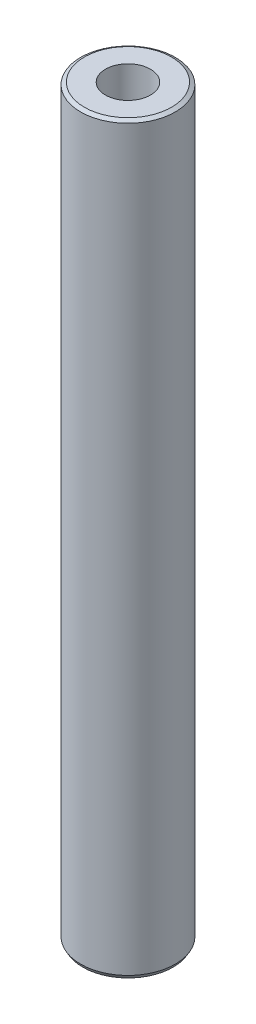
ISO-10303-21;
HEADER;
FILE_DESCRIPTION(('STEP AP214'),'2;1');
FILE_NAME('part.step','',(''),(''),'','','');
FILE_SCHEMA(('AUTOMOTIVE_DESIGN { 1 0 10303 214 1 1 1 1 }'));
ENDSEC;
DATA;
#1=APPLICATION_CONTEXT('core data for automotive mechanical design processes');
#2=APPLICATION_PROTOCOL_DEFINITION('international standard','automotive_design',2000,#1);
#3=PRODUCT_CONTEXT('',#1,'mechanical');
#4=PRODUCT('Part','Part','',(#3));
#5=PRODUCT_RELATED_PRODUCT_CATEGORY('part','',(#4));
#6=PRODUCT_DEFINITION_FORMATION('','',#4);
#7=PRODUCT_DEFINITION_CONTEXT('part definition',#1,'design');
#8=PRODUCT_DEFINITION('design','',#6,#7);
#9=PRODUCT_DEFINITION_SHAPE('','',#8);
#10=(LENGTH_UNIT() NAMED_UNIT(*) SI_UNIT(.MILLI.,.METRE.));
#11=(NAMED_UNIT(*) PLANE_ANGLE_UNIT() SI_UNIT($,.RADIAN.));
#12=(NAMED_UNIT(*) SI_UNIT($,.STERADIAN.) SOLID_ANGLE_UNIT());
#13=UNCERTAINTY_MEASURE_WITH_UNIT(LENGTH_MEASURE(1.E-05),#10,'distance_accuracy_value','');
#14=(GEOMETRIC_REPRESENTATION_CONTEXT(3) GLOBAL_UNCERTAINTY_ASSIGNED_CONTEXT((#13)) GLOBAL_UNIT_ASSIGNED_CONTEXT((#10,
#11,#12)) REPRESENTATION_CONTEXT('',''));
#15=CARTESIAN_POINT('',(0.,0.,0.));
#16=DIRECTION('',(0.,0.,1.));
#17=DIRECTION('',(1.,0.,0.));
#18=AXIS2_PLACEMENT_3D('',#15,#16,#17);
#19=CARTESIAN_POINT('',(0.,117.883172152709,0.));
#20=DIRECTION('',(0.,-1.,0.));
#21=DIRECTION('',(0.,0.,-1.));
#22=AXIS2_PLACEMENT_3D('',#19,#20,#21);
#23=CYLINDRICAL_SURFACE('',#22,7.5);
#24=CARTESIAN_POINT('',(0.,117.538958751515,0.));
#25=DIRECTION('',(0.,1.,0.));
#26=DIRECTION('',(0.,0.,1.));
#27=AXIS2_PLACEMENT_3D('',#24,#25,#26);
#28=CIRCLE('',#27,7.5);
#29=CARTESIAN_POINT('',(0.,117.538958751515,7.5));
#30=VERTEX_POINT('',#29);
#31=EDGE_CURVE('E50',#30,#30,#28,.F.);
#32=ORIENTED_EDGE('',*,*,#31,.T.);
#33=EDGE_LOOP('',(#32));
#34=FACE_BOUND('',#33,.T.);
#35=CARTESIAN_POINT('',(0.,0.596195099513974,0.));
#36=DIRECTION('',(0.,1.,0.));
#37=DIRECTION('',(0.,0.,1.));
#38=AXIS2_PLACEMENT_3D('',#35,#36,#37);
#39=CIRCLE('',#38,7.5);
#40=CARTESIAN_POINT('',(0.,0.596195099513974,7.5));
#41=VERTEX_POINT('',#40);
#42=EDGE_CURVE('E51',#41,#41,#39,.T.);
#43=ORIENTED_EDGE('',*,*,#42,.T.);
#44=EDGE_LOOP('',(#43));
#45=FACE_BOUND('',#44,.T.);
#46=ADVANCED_FACE('F39',(#34,#45),#23,.T.);
#47=CARTESIAN_POINT('',(0.,117.883172152709,0.));
#48=DIRECTION('',(0.,1.,0.));
#49=DIRECTION('',(0.,0.,1.));
#50=AXIS2_PLACEMENT_3D('',#47,#48,#49);
#51=PLANE('',#50);
#52=CARTESIAN_POINT('',(0.,117.883172152709,0.));
#53=DIRECTION('',(0.,1.,0.));
#54=DIRECTION('',(0.,0.,1.));
#55=AXIS2_PLACEMENT_3D('',#52,#53,#54);
#56=CIRCLE('',#55,6.903804900486);
#57=CARTESIAN_POINT('',(0.,117.883172152709,6.903804900486));
#58=VERTEX_POINT('',#57);
#59=EDGE_CURVE('E54',#58,#58,#56,.T.);
#60=ORIENTED_EDGE('',*,*,#59,.T.);
#61=EDGE_LOOP('',(#60));
#62=FACE_BOUND('',#61,.T.);
#63=CARTESIAN_POINT('',(0.,117.883172152709,0.));
#64=DIRECTION('',(0.,1.,0.));
#65=DIRECTION('',(0.,0.,1.));
#66=AXIS2_PLACEMENT_3D('',#63,#64,#65);
#67=CIRCLE('',#66,3.56259355771573);
#68=CARTESIAN_POINT('',(0.,117.883172152709,3.56259355771573));
#69=VERTEX_POINT('',#68);
#70=EDGE_CURVE('E58',#69,#69,#67,.T.);
#71=ORIENTED_EDGE('',*,*,#70,.F.);
#72=EDGE_LOOP('',(#71));
#73=FACE_BOUND('',#72,.T.);
#74=ADVANCED_FACE('F69',(#62,#73),#51,.T.);
#75=CARTESIAN_POINT('',(0.,0.,0.));
#76=DIRECTION('',(0.,1.,0.));
#77=DIRECTION('',(0.,0.,1.));
#78=AXIS2_PLACEMENT_3D('',#75,#76,#77);
#79=PLANE('',#78);
#80=CARTESIAN_POINT('',(0.,0.,0.));
#81=DIRECTION('',(0.,1.,0.));
#82=DIRECTION('',(0.,0.,1.));
#83=AXIS2_PLACEMENT_3D('',#80,#81,#82);
#84=CIRCLE('',#83,7.15578659880607);
#85=CARTESIAN_POINT('',(0.,0.,7.15578659880607));
#86=VERTEX_POINT('',#85);
#87=EDGE_CURVE('E10',#86,#86,#84,.F.);
#88=ORIENTED_EDGE('',*,*,#87,.T.);
#89=EDGE_LOOP('',(#88));
#90=FACE_BOUND('',#89,.T.);
#91=CARTESIAN_POINT('',(0.,0.,0.));
#92=DIRECTION('',(0.,1.,0.));
#93=DIRECTION('',(0.,0.,1.));
#94=AXIS2_PLACEMENT_3D('',#91,#92,#93);
#95=CIRCLE('',#94,3.56259355771573);
#96=CARTESIAN_POINT('',(0.,0.,3.56259355771573));
#97=VERTEX_POINT('',#96);
#98=EDGE_CURVE('E63',#97,#97,#95,.T.);
#99=ORIENTED_EDGE('',*,*,#98,.T.);
#100=EDGE_LOOP('',(#99));
#101=FACE_BOUND('',#100,.T.);
#102=ADVANCED_FACE('F75',(#90,#101),#79,.F.);
#103=CARTESIAN_POINT('',(0.,117.883172152709,0.));
#104=DIRECTION('',(0.,-1.,0.));
#105=DIRECTION('',(0.,0.,-1.));
#106=AXIS2_PLACEMENT_3D('',#103,#104,#105);
#107=CYLINDRICAL_SURFACE('',#106,3.56259355771573);
#108=ORIENTED_EDGE('',*,*,#70,.T.);
#109=EDGE_LOOP('',(#108));
#110=FACE_BOUND('',#109,.T.);
#111=ORIENTED_EDGE('',*,*,#98,.F.);
#112=EDGE_LOOP('',(#111));
#113=FACE_BOUND('',#112,.T.);
#114=ADVANCED_FACE('F70',(#110,#113),#107,.F.);
#115=CARTESIAN_POINT('',(0.,117.883172152709,0.));
#116=DIRECTION('',(0.,-1.,0.));
#117=DIRECTION('',(0.,0.,-1.));
#118=AXIS2_PLACEMENT_3D('',#115,#116,#117);
#119=CONICAL_SURFACE('',#118,6.903804900486,1.0471975511966);
#120=ORIENTED_EDGE('',*,*,#31,.F.);
#121=EDGE_LOOP('',(#120));
#122=FACE_BOUND('',#121,.T.);
#123=ORIENTED_EDGE('',*,*,#59,.F.);
#124=EDGE_LOOP('',(#123));
#125=FACE_BOUND('',#124,.T.);
#126=ADVANCED_FACE('F81',(#122,#125),#119,.T.);
#127=CARTESIAN_POINT('',(0.,0.596195099513974,0.));
#128=DIRECTION('',(0.,1.,0.));
#129=DIRECTION('',(0.,0.,1.));
#130=AXIS2_PLACEMENT_3D('',#127,#128,#129);
#131=CONICAL_SURFACE('',#130,7.5,0.523598775598298);
#132=ORIENTED_EDGE('',*,*,#87,.F.);
#133=EDGE_LOOP('',(#132));
#134=FACE_BOUND('',#133,.T.);
#135=ORIENTED_EDGE('',*,*,#42,.F.);
#136=EDGE_LOOP('',(#135));
#137=FACE_BOUND('',#136,.T.);
#138=ADVANCED_FACE('F45',(#134,#137),#131,.T.);
#139=CLOSED_SHELL('',(#46,#74,#102,#114,#126,#138));
#140=MANIFOLD_SOLID_BREP('B2',#139);
#141=ADVANCED_BREP_SHAPE_REPRESENTATION('',(#18,#140),#14);
#142=SHAPE_DEFINITION_REPRESENTATION(#9,#141);
ENDSEC;
END-ISO-10303-21;
